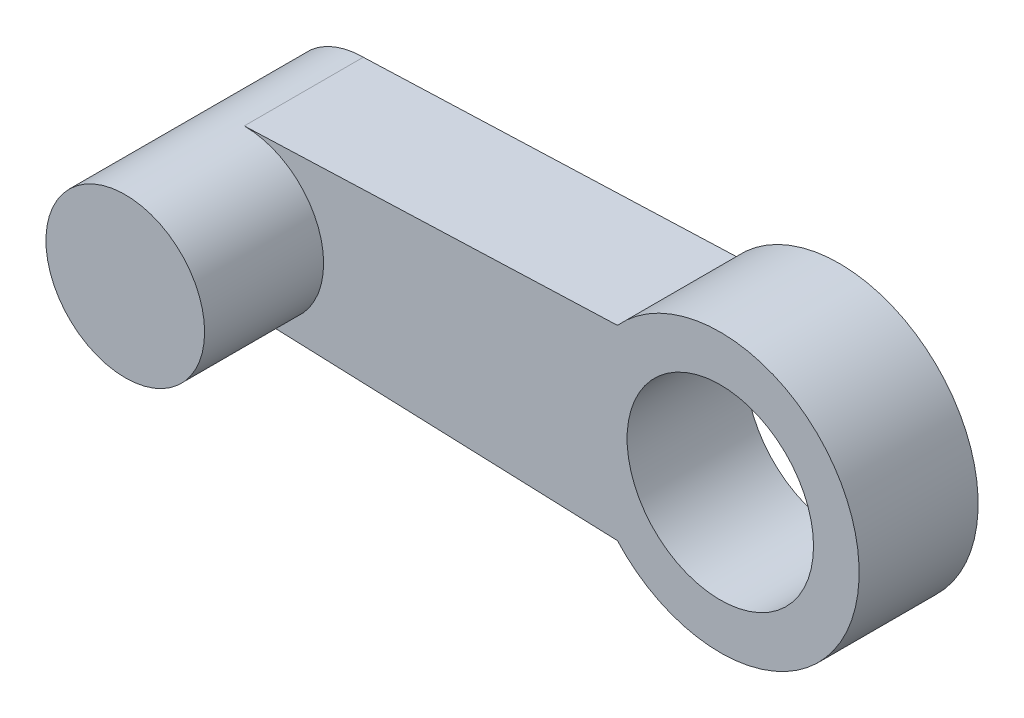
ISO-10303-21;
HEADER;
FILE_DESCRIPTION(('STEP AP214'),'2;1');
FILE_NAME('part.step','',(''),(''),'','','');
FILE_SCHEMA(('AUTOMOTIVE_DESIGN { 1 0 10303 214 1 1 1 1 }'));
ENDSEC;
DATA;
#1=APPLICATION_CONTEXT('core data for automotive mechanical design processes');
#2=APPLICATION_PROTOCOL_DEFINITION('international standard','automotive_design',2000,#1);
#3=PRODUCT_CONTEXT('',#1,'mechanical');
#4=PRODUCT('Part','Part','',(#3));
#5=PRODUCT_RELATED_PRODUCT_CATEGORY('part','',(#4));
#6=PRODUCT_DEFINITION_FORMATION('','',#4);
#7=PRODUCT_DEFINITION_CONTEXT('part definition',#1,'design');
#8=PRODUCT_DEFINITION('design','',#6,#7);
#9=PRODUCT_DEFINITION_SHAPE('','',#8);
#10=(LENGTH_UNIT() NAMED_UNIT(*) SI_UNIT(.MILLI.,.METRE.));
#11=(NAMED_UNIT(*) PLANE_ANGLE_UNIT() SI_UNIT($,.RADIAN.));
#12=(NAMED_UNIT(*) SI_UNIT($,.STERADIAN.) SOLID_ANGLE_UNIT());
#13=UNCERTAINTY_MEASURE_WITH_UNIT(LENGTH_MEASURE(1.E-05),#10,'distance_accuracy_value','');
#14=(GEOMETRIC_REPRESENTATION_CONTEXT(3) GLOBAL_UNCERTAINTY_ASSIGNED_CONTEXT((#13)) GLOBAL_UNIT_ASSIGNED_CONTEXT((#10,
#11,#12)) REPRESENTATION_CONTEXT('',''));
#15=CARTESIAN_POINT('',(0.,0.,0.));
#16=DIRECTION('',(0.,0.,1.));
#17=DIRECTION('',(1.,0.,0.));
#18=AXIS2_PLACEMENT_3D('',#15,#16,#17);
#19=CARTESIAN_POINT('',(-0.089440802020708,2.40372347859468,3.));
#20=DIRECTION('',(-0.0371835405784303,0.999308453036425,0.));
#21=DIRECTION('',(-0.999308453036425,-0.0371835405784303,0.));
#22=AXIS2_PLACEMENT_3D('',#19,#20,#21);
#23=PLANE('',#22);
#24=DIRECTION('',(0.999308453036425,0.0371835405784303,0.));
#25=VECTOR('',#24,1.);
#26=CARTESIAN_POINT('',(-0.089440802020708,2.40372347859468,0.));
#27=LINE('',#26,#25);
#28=CARTESIAN_POINT('',(-10.9395179752261,1.99999999999993,0.));
#29=VERTEX_POINT('',#28);
#30=CARTESIAN_POINT('',(-1.53326044509472,2.35000000000001,0.));
#31=VERTEX_POINT('',#30);
#32=EDGE_CURVE('E101',#29,#31,#27,.T.);
#33=ORIENTED_EDGE('',*,*,#32,.F.);
#34=DIRECTION('',(0.,0.,-1.));
#35=VECTOR('',#34,1.);
#36=CARTESIAN_POINT('',(-10.9395179752261,1.99999999999993,3.));
#37=LINE('',#36,#35);
#38=CARTESIAN_POINT('',(-10.9395179752261,1.99999999999991,3.));
#39=VERTEX_POINT('',#38);
#40=EDGE_CURVE('E48',#39,#29,#37,.T.);
#41=ORIENTED_EDGE('',*,*,#40,.F.);
#42=DIRECTION('',(0.999308453036425,0.0371835405784303,0.));
#43=VECTOR('',#42,1.);
#44=CARTESIAN_POINT('',(-0.089440802020708,2.40372347859468,3.));
#45=LINE('',#44,#43);
#46=CARTESIAN_POINT('',(-1.53326044509472,2.35000000000001,3.));
#47=VERTEX_POINT('',#46);
#48=EDGE_CURVE('E92',#39,#47,#45,.T.);
#49=ORIENTED_EDGE('',*,*,#48,.T.);
#50=DIRECTION('',(0.,0.,-1.));
#51=VECTOR('',#50,1.);
#52=CARTESIAN_POINT('',(-1.53326044509472,2.35000000000001,3.));
#53=LINE('',#52,#51);
#54=EDGE_CURVE('E87',#47,#31,#53,.T.);
#55=ORIENTED_EDGE('',*,*,#54,.T.);
#56=EDGE_LOOP('',(#33,#41,#49,#55));
#57=FACE_BOUND('',#56,.T.);
#58=ADVANCED_FACE('F45',(#57),#23,.T.);
#59=CARTESIAN_POINT('',(-10.9395179752261,0.,3.));
#60=DIRECTION('',(0.,0.,-1.));
#61=DIRECTION('',(-1.,0.,0.));
#62=AXIS2_PLACEMENT_3D('',#59,#60,#61);
#63=CYLINDRICAL_SURFACE('',#62,2.);
#64=CARTESIAN_POINT('',(-10.9395179752261,0.,0.));
#65=DIRECTION('',(0.,0.,1.));
#66=DIRECTION('',(1.,0.,0.));
#67=AXIS2_PLACEMENT_3D('',#64,#65,#66);
#68=CIRCLE('',#67,2.);
#69=CARTESIAN_POINT('',(-10.9395179752261,-2.00000000000005,0.));
#70=VERTEX_POINT('',#69);
#71=EDGE_CURVE('E109',#29,#70,#68,.T.);
#72=ORIENTED_EDGE('',*,*,#71,.T.);
#73=DIRECTION('',(0.,0.,-1.));
#74=VECTOR('',#73,1.);
#75=CARTESIAN_POINT('',(-10.9395179752261,-2.00000000000005,3.));
#76=LINE('',#75,#74);
#77=CARTESIAN_POINT('',(-10.9395179752261,-2.00000000000005,3.));
#78=VERTEX_POINT('',#77);
#79=EDGE_CURVE('E105',#78,#70,#76,.T.);
#80=ORIENTED_EDGE('',*,*,#79,.F.);
#81=CARTESIAN_POINT('',(-10.9395179752261,0.,3.));
#82=DIRECTION('',(0.,0.,1.));
#83=DIRECTION('',(1.,0.,0.));
#84=AXIS2_PLACEMENT_3D('',#81,#82,#83);
#85=CIRCLE('',#84,2.);
#86=EDGE_CURVE('E11',#78,#39,#85,.T.);
#87=ORIENTED_EDGE('',*,*,#86,.T.);
#88=ORIENTED_EDGE('',*,*,#40,.T.);
#89=EDGE_LOOP('',(#72,#80,#87,#88));
#90=FACE_BOUND('',#89,.T.);
#91=CARTESIAN_POINT('',(-10.9395179752261,0.,6.));
#92=DIRECTION('',(0.,0.,1.));
#93=DIRECTION('',(1.,0.,0.));
#94=AXIS2_PLACEMENT_3D('',#91,#92,#93);
#95=CIRCLE('',#94,2.);
#96=CARTESIAN_POINT('',(-8.93951797522613,0.,6.));
#97=VERTEX_POINT('',#96);
#98=EDGE_CURVE('E124',#97,#97,#95,.T.);
#99=ORIENTED_EDGE('',*,*,#98,.F.);
#100=EDGE_LOOP('',(#99));
#101=FACE_BOUND('',#100,.T.);
#102=ADVANCED_FACE('F106',(#90,#101),#63,.T.);
#103=CARTESIAN_POINT('',(-0.0894408020206935,-2.40372347859467,3.));
#104=DIRECTION('',(0.0371835405784244,0.999308453036425,0.));
#105=DIRECTION('',(-0.999308453036425,0.0371835405784244,0.));
#106=AXIS2_PLACEMENT_3D('',#103,#104,#105);
#107=PLANE('',#106);
#108=DIRECTION('',(0.999308453036425,-0.0371835405784244,0.));
#109=VECTOR('',#108,1.);
#110=CARTESIAN_POINT('',(-0.0894408020206935,-2.40372347859467,0.));
#111=LINE('',#110,#109);
#112=CARTESIAN_POINT('',(-1.53326044509472,-2.35000000000001,0.));
#113=VERTEX_POINT('',#112);
#114=EDGE_CURVE('E81',#70,#113,#111,.T.);
#115=ORIENTED_EDGE('',*,*,#114,.T.);
#116=DIRECTION('',(0.,0.,-1.));
#117=VECTOR('',#116,1.);
#118=CARTESIAN_POINT('',(-1.53326044509472,-2.35000000000001,3.));
#119=LINE('',#118,#117);
#120=CARTESIAN_POINT('',(-1.53326044509472,-2.35000000000001,3.));
#121=VERTEX_POINT('',#120);
#122=EDGE_CURVE('E111',#121,#113,#119,.T.);
#123=ORIENTED_EDGE('',*,*,#122,.F.);
#124=DIRECTION('',(0.999308453036425,-0.0371835405784244,0.));
#125=VECTOR('',#124,1.);
#126=CARTESIAN_POINT('',(-0.0894408020206935,-2.40372347859467,3.));
#127=LINE('',#126,#125);
#128=EDGE_CURVE('E97',#78,#121,#127,.T.);
#129=ORIENTED_EDGE('',*,*,#128,.F.);
#130=ORIENTED_EDGE('',*,*,#79,.T.);
#131=EDGE_LOOP('',(#115,#123,#129,#130));
#132=FACE_BOUND('',#131,.T.);
#133=ADVANCED_FACE('F112',(#132),#107,.F.);
#134=CARTESIAN_POINT('',(1.06048202477386,0.,3.));
#135=DIRECTION('',(0.,0.,-1.));
#136=DIRECTION('',(-1.,0.,0.));
#137=AXIS2_PLACEMENT_3D('',#134,#135,#136);
#138=CYLINDRICAL_SURFACE('',#137,3.5);
#139=CARTESIAN_POINT('',(1.06048202477386,0.,0.));
#140=DIRECTION('',(0.,0.,1.));
#141=DIRECTION('',(1.,0.,0.));
#142=AXIS2_PLACEMENT_3D('',#139,#140,#141);
#143=CIRCLE('',#142,3.5);
#144=EDGE_CURVE('E129',#113,#31,#143,.T.);
#145=ORIENTED_EDGE('',*,*,#144,.T.);
#146=ORIENTED_EDGE('',*,*,#54,.F.);
#147=CARTESIAN_POINT('',(1.06048202477386,0.,3.));
#148=DIRECTION('',(0.,0.,1.));
#149=DIRECTION('',(1.,0.,0.));
#150=AXIS2_PLACEMENT_3D('',#147,#148,#149);
#151=CIRCLE('',#150,3.5);
#152=EDGE_CURVE('E63',#121,#47,#151,.T.);
#153=ORIENTED_EDGE('',*,*,#152,.F.);
#154=ORIENTED_EDGE('',*,*,#122,.T.);
#155=EDGE_LOOP('',(#145,#146,#153,#154));
#156=FACE_BOUND('',#155,.T.);
#157=ADVANCED_FACE('F140',(#156),#138,.T.);
#158=CARTESIAN_POINT('',(1.06048202477386,0.,3.));
#159=DIRECTION('',(0.,0.,-1.));
#160=DIRECTION('',(-1.,0.,0.));
#161=AXIS2_PLACEMENT_3D('',#158,#159,#160);
#162=CYLINDRICAL_SURFACE('',#161,2.35);
#163=CARTESIAN_POINT('',(1.06048202477386,0.,3.));
#164=DIRECTION('',(0.,0.,1.));
#165=DIRECTION('',(1.,0.,0.));
#166=AXIS2_PLACEMENT_3D('',#163,#164,#165);
#167=CIRCLE('',#166,2.35);
#168=CARTESIAN_POINT('',(3.41048202477386,0.,3.));
#169=VERTEX_POINT('',#168);
#170=EDGE_CURVE('E116',#169,#169,#167,.T.);
#171=ORIENTED_EDGE('',*,*,#170,.T.);
#172=EDGE_LOOP('',(#171));
#173=FACE_BOUND('',#172,.T.);
#174=CARTESIAN_POINT('',(1.06048202477386,0.,0.));
#175=DIRECTION('',(0.,0.,1.));
#176=DIRECTION('',(1.,0.,0.));
#177=AXIS2_PLACEMENT_3D('',#174,#175,#176);
#178=CIRCLE('',#177,2.35);
#179=CARTESIAN_POINT('',(3.41048202477386,0.,0.));
#180=VERTEX_POINT('',#179);
#181=EDGE_CURVE('E98',#180,#180,#178,.T.);
#182=ORIENTED_EDGE('',*,*,#181,.F.);
#183=EDGE_LOOP('',(#182));
#184=FACE_BOUND('',#183,.T.);
#185=ADVANCED_FACE('F149',(#173,#184),#162,.F.);
#186=CARTESIAN_POINT('',(0.,0.,3.));
#187=DIRECTION('',(0.,0.,1.));
#188=DIRECTION('',(1.,0.,0.));
#189=AXIS2_PLACEMENT_3D('',#186,#187,#188);
#190=PLANE('',#189);
#191=ORIENTED_EDGE('',*,*,#86,.F.);
#192=ORIENTED_EDGE('',*,*,#128,.T.);
#193=ORIENTED_EDGE('',*,*,#152,.T.);
#194=ORIENTED_EDGE('',*,*,#48,.F.);
#195=EDGE_LOOP('',(#191,#192,#193,#194));
#196=FACE_BOUND('',#195,.T.);
#197=ORIENTED_EDGE('',*,*,#170,.F.);
#198=EDGE_LOOP('',(#197));
#199=FACE_BOUND('',#198,.T.);
#200=ADVANCED_FACE('F94',(#196,#199),#190,.T.);
#201=CARTESIAN_POINT('',(0.,0.,0.));
#202=DIRECTION('',(0.,0.,1.));
#203=DIRECTION('',(1.,0.,0.));
#204=AXIS2_PLACEMENT_3D('',#201,#202,#203);
#205=PLANE('',#204);
#206=ORIENTED_EDGE('',*,*,#32,.T.);
#207=ORIENTED_EDGE('',*,*,#144,.F.);
#208=ORIENTED_EDGE('',*,*,#114,.F.);
#209=ORIENTED_EDGE('',*,*,#71,.F.);
#210=EDGE_LOOP('',(#206,#207,#208,#209));
#211=FACE_BOUND('',#210,.T.);
#212=ORIENTED_EDGE('',*,*,#181,.T.);
#213=EDGE_LOOP('',(#212));
#214=FACE_BOUND('',#213,.T.);
#215=ADVANCED_FACE('F142',(#211,#214),#205,.F.);
#216=CARTESIAN_POINT('',(-10.9395179752261,0.,6.));
#217=DIRECTION('',(0.,0.,1.));
#218=DIRECTION('',(1.,0.,0.));
#219=AXIS2_PLACEMENT_3D('',#216,#217,#218);
#220=PLANE('',#219);
#221=ORIENTED_EDGE('',*,*,#98,.T.);
#222=EDGE_LOOP('',(#221));
#223=FACE_BOUND('',#222,.T.);
#224=ADVANCED_FACE('F145',(#223),#220,.T.);
#225=CLOSED_SHELL('',(#58,#102,#133,#157,#185,#200,#215,#224));
#226=MANIFOLD_SOLID_BREP('B2',#225);
#227=ADVANCED_BREP_SHAPE_REPRESENTATION('',(#18,#226),#14);
#228=SHAPE_DEFINITION_REPRESENTATION(#9,#227);
ENDSEC;
END-ISO-10303-21;
